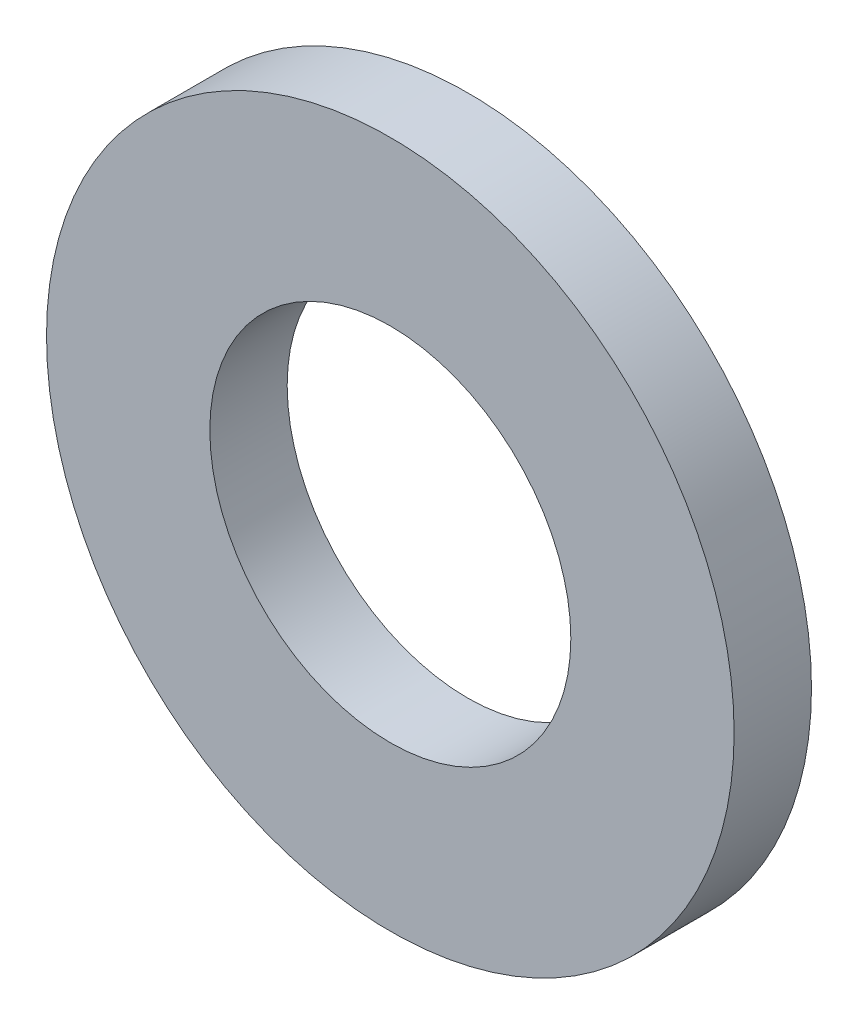
ISO-10303-21;
HEADER;
FILE_DESCRIPTION(('STEP AP214'),'2;1');
FILE_NAME('part.step','',(''),(''),'','','');
FILE_SCHEMA(('AUTOMOTIVE_DESIGN { 1 0 10303 214 1 1 1 1 }'));
ENDSEC;
DATA;
#1=APPLICATION_CONTEXT('core data for automotive mechanical design processes');
#2=APPLICATION_PROTOCOL_DEFINITION('international standard','automotive_design',2000,#1);
#3=PRODUCT_CONTEXT('',#1,'mechanical');
#4=PRODUCT('Part','Part','',(#3));
#5=PRODUCT_RELATED_PRODUCT_CATEGORY('part','',(#4));
#6=PRODUCT_DEFINITION_FORMATION('','',#4);
#7=PRODUCT_DEFINITION_CONTEXT('part definition',#1,'design');
#8=PRODUCT_DEFINITION('design','',#6,#7);
#9=PRODUCT_DEFINITION_SHAPE('','',#8);
#10=(LENGTH_UNIT() NAMED_UNIT(*) SI_UNIT(.MILLI.,.METRE.));
#11=(NAMED_UNIT(*) PLANE_ANGLE_UNIT() SI_UNIT($,.RADIAN.));
#12=(NAMED_UNIT(*) SI_UNIT($,.STERADIAN.) SOLID_ANGLE_UNIT());
#13=UNCERTAINTY_MEASURE_WITH_UNIT(LENGTH_MEASURE(1.E-05),#10,'distance_accuracy_value','');
#14=(GEOMETRIC_REPRESENTATION_CONTEXT(3) GLOBAL_UNCERTAINTY_ASSIGNED_CONTEXT((#13)) GLOBAL_UNIT_ASSIGNED_CONTEXT((#10,
#11,#12)) REPRESENTATION_CONTEXT('',''));
#15=CARTESIAN_POINT('',(0.,0.,0.));
#16=DIRECTION('',(0.,0.,1.));
#17=DIRECTION('',(1.,0.,0.));
#18=AXIS2_PLACEMENT_3D('',#15,#16,#17);
#19=CARTESIAN_POINT('',(0.,0.,1.7999999999998));
#20=DIRECTION('',(0.,0.,0.999999999999999));
#21=DIRECTION('',(1.,0.,0.));
#22=AXIS2_PLACEMENT_3D('',#19,#20,#21);
#23=PLANE('',#22);
#24=CARTESIAN_POINT('',(0.,0.,1.7999999999998));
#25=DIRECTION('',(0.,0.,0.999999999999999));
#26=DIRECTION('',(1.,0.,0.));
#27=AXIS2_PLACEMENT_3D('',#24,#25,#26);
#28=CIRCLE('',#27,8.);
#29=CARTESIAN_POINT('',(8.,0.,1.7999999999998));
#30=VERTEX_POINT('',#29);
#31=EDGE_CURVE('E12',#30,#30,#28,.T.);
#32=ORIENTED_EDGE('',*,*,#31,.T.);
#33=EDGE_LOOP('',(#32));
#34=FACE_BOUND('',#33,.T.);
#35=CARTESIAN_POINT('',(0.,0.,1.7999999999998));
#36=DIRECTION('',(0.,0.,0.999999999999999));
#37=DIRECTION('',(1.,0.,0.));
#38=AXIS2_PLACEMENT_3D('',#35,#36,#37);
#39=CIRCLE('',#38,4.2);
#40=CARTESIAN_POINT('',(4.2,0.,1.7999999999998));
#41=VERTEX_POINT('',#40);
#42=EDGE_CURVE('E51',#41,#41,#39,.T.);
#43=ORIENTED_EDGE('',*,*,#42,.F.);
#44=EDGE_LOOP('',(#43));
#45=FACE_BOUND('',#44,.T.);
#46=ADVANCED_FACE('F40',(#34,#45),#23,.T.);
#47=CARTESIAN_POINT('',(0.,0.,0.));
#48=DIRECTION('',(0.,0.,0.999999999999999));
#49=DIRECTION('',(1.,0.,0.));
#50=AXIS2_PLACEMENT_3D('',#47,#48,#49);
#51=PLANE('',#50);
#52=CARTESIAN_POINT('',(0.,0.,0.));
#53=DIRECTION('',(0.,0.,0.999999999999999));
#54=DIRECTION('',(1.,0.,0.));
#55=AXIS2_PLACEMENT_3D('',#52,#53,#54);
#56=CIRCLE('',#55,8.);
#57=CARTESIAN_POINT('',(8.,0.,0.));
#58=VERTEX_POINT('',#57);
#59=EDGE_CURVE('E44',#58,#58,#56,.T.);
#60=ORIENTED_EDGE('',*,*,#59,.F.);
#61=EDGE_LOOP('',(#60));
#62=FACE_BOUND('',#61,.T.);
#63=CARTESIAN_POINT('',(0.,0.,0.));
#64=DIRECTION('',(0.,0.,0.999999999999999));
#65=DIRECTION('',(1.,0.,0.));
#66=AXIS2_PLACEMENT_3D('',#63,#64,#65);
#67=CIRCLE('',#66,4.2);
#68=CARTESIAN_POINT('',(4.2,0.,0.));
#69=VERTEX_POINT('',#68);
#70=EDGE_CURVE('E53',#69,#69,#67,.T.);
#71=ORIENTED_EDGE('',*,*,#70,.T.);
#72=EDGE_LOOP('',(#71));
#73=FACE_BOUND('',#72,.T.);
#74=ADVANCED_FACE('F63',(#62,#73),#51,.F.);
#75=CARTESIAN_POINT('',(0.,0.,1.7999999999998));
#76=DIRECTION('',(0.,0.,-0.999999999999999));
#77=DIRECTION('',(-1.,0.,0.));
#78=AXIS2_PLACEMENT_3D('',#75,#76,#77);
#79=CYLINDRICAL_SURFACE('',#78,8.);
#80=ORIENTED_EDGE('',*,*,#31,.F.);
#81=EDGE_LOOP('',(#80));
#82=FACE_BOUND('',#81,.T.);
#83=ORIENTED_EDGE('',*,*,#59,.T.);
#84=EDGE_LOOP('',(#83));
#85=FACE_BOUND('',#84,.T.);
#86=ADVANCED_FACE('F42',(#82,#85),#79,.T.);
#87=CARTESIAN_POINT('',(0.,0.,1.7999999999998));
#88=DIRECTION('',(0.,0.,-0.999999999999999));
#89=DIRECTION('',(-1.,0.,0.));
#90=AXIS2_PLACEMENT_3D('',#87,#88,#89);
#91=CYLINDRICAL_SURFACE('',#90,4.2);
#92=ORIENTED_EDGE('',*,*,#42,.T.);
#93=EDGE_LOOP('',(#92));
#94=FACE_BOUND('',#93,.T.);
#95=ORIENTED_EDGE('',*,*,#70,.F.);
#96=EDGE_LOOP('',(#95));
#97=FACE_BOUND('',#96,.T.);
#98=ADVANCED_FACE('F59',(#94,#97),#91,.F.);
#99=CLOSED_SHELL('',(#46,#74,#86,#98));
#100=MANIFOLD_SOLID_BREP('B2',#99);
#101=ADVANCED_BREP_SHAPE_REPRESENTATION('',(#18,#100),#14);
#102=SHAPE_DEFINITION_REPRESENTATION(#9,#101);
ENDSEC;
END-ISO-10303-21;
